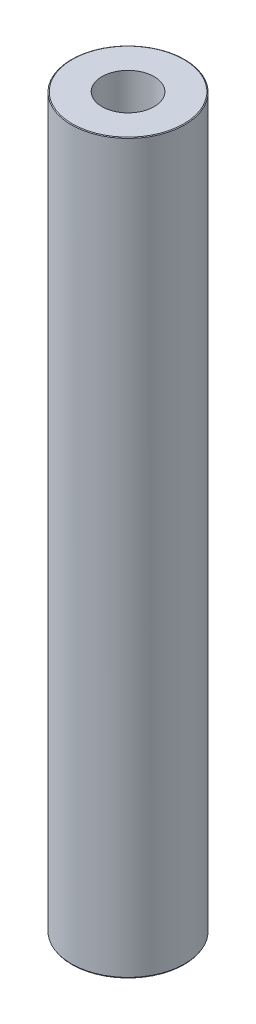
ISO-10303-21;
HEADER;
FILE_DESCRIPTION(('STEP AP214'),'2;1');
FILE_NAME('part.step','',(''),(''),'','','');
FILE_SCHEMA(('AUTOMOTIVE_DESIGN { 1 0 10303 214 1 1 1 1 }'));
ENDSEC;
DATA;
#1=APPLICATION_CONTEXT('core data for automotive mechanical design processes');
#2=APPLICATION_PROTOCOL_DEFINITION('international standard','automotive_design',2000,#1);
#3=PRODUCT_CONTEXT('',#1,'mechanical');
#4=PRODUCT('Part','Part','',(#3));
#5=PRODUCT_RELATED_PRODUCT_CATEGORY('part','',(#4));
#6=PRODUCT_DEFINITION_FORMATION('','',#4);
#7=PRODUCT_DEFINITION_CONTEXT('part definition',#1,'design');
#8=PRODUCT_DEFINITION('design','',#6,#7);
#9=PRODUCT_DEFINITION_SHAPE('','',#8);
#10=(LENGTH_UNIT() NAMED_UNIT(*) SI_UNIT(.MILLI.,.METRE.));
#11=(NAMED_UNIT(*) PLANE_ANGLE_UNIT() SI_UNIT($,.RADIAN.));
#12=(NAMED_UNIT(*) SI_UNIT($,.STERADIAN.) SOLID_ANGLE_UNIT());
#13=UNCERTAINTY_MEASURE_WITH_UNIT(LENGTH_MEASURE(1.E-05),#10,'distance_accuracy_value','');
#14=(GEOMETRIC_REPRESENTATION_CONTEXT(3) GLOBAL_UNCERTAINTY_ASSIGNED_CONTEXT((#13)) GLOBAL_UNIT_ASSIGNED_CONTEXT((#10,
#11,#12)) REPRESENTATION_CONTEXT('',''));
#15=CARTESIAN_POINT('',(0.,0.,0.));
#16=DIRECTION('',(0.,0.,1.));
#17=DIRECTION('',(1.,0.,0.));
#18=AXIS2_PLACEMENT_3D('',#15,#16,#17);
#19=CARTESIAN_POINT('',(0.,353.36021394259,0.));
#20=DIRECTION('',(0.,-1.,0.));
#21=DIRECTION('',(0.,0.,-1.));
#22=AXIS2_PLACEMENT_3D('',#19,#20,#21);
#23=CYLINDRICAL_SURFACE('',#22,27.5);
#24=CARTESIAN_POINT('',(0.,353.113992735957,0.));
#25=DIRECTION('',(0.,1.,0.));
#26=DIRECTION('',(0.,0.,1.));
#27=AXIS2_PLACEMENT_3D('',#24,#25,#26);
#28=CIRCLE('',#27,27.5);
#29=CARTESIAN_POINT('',(0.,353.113992735957,-27.5));
#30=VERTEX_POINT('',#29);
#31=EDGE_CURVE('E50',#30,#30,#28,.F.);
#32=CARTESIAN_POINT('',(0.,0.426467639790484,0.));
#33=DIRECTION('',(0.,1.,0.));
#34=DIRECTION('',(0.,0.,1.));
#35=AXIS2_PLACEMENT_3D('',#32,#33,#34);
#36=CIRCLE('',#35,27.5);
#37=CARTESIAN_POINT('',(0.,0.426467639790429,-27.5));
#38=VERTEX_POINT('',#37);
#39=EDGE_CURVE('E51',#38,#38,#36,.T.);
#40=CARTESIAN_POINT('',(0.,353.113992735957,-27.5));
#41=CARTESIAN_POINT('',(0.,349.440164349538,-27.5));
#42=CARTESIAN_POINT('',(0.,345.76633596312,-27.5));
#43=CARTESIAN_POINT('',(0.,338.418679190283,-27.5));
#44=CARTESIAN_POINT('',(0.,334.744850803865,-27.5));
#45=CARTESIAN_POINT('',(0.,327.397194031028,-27.5));
#46=CARTESIAN_POINT('',(0.,323.723365644609,-27.5));
#47=CARTESIAN_POINT('',(0.,316.375708871773,-27.5));
#48=CARTESIAN_POINT('',(0.,312.701880485354,-27.5));
#49=CARTESIAN_POINT('',(0.,305.354223712517,-27.5));
#50=CARTESIAN_POINT('',(0.,301.680395326099,-27.5));
#51=CARTESIAN_POINT('',(0.,294.332738553262,-27.5));
#52=CARTESIAN_POINT('',(0.,290.658910166844,-27.5));
#53=CARTESIAN_POINT('',(0.,283.311253394007,-27.5));
#54=CARTESIAN_POINT('',(0.,279.637425007589,-27.5));
#55=CARTESIAN_POINT('',(0.,272.289768234752,-27.5));
#56=CARTESIAN_POINT('',(0.,268.615939848333,-27.5));
#57=CARTESIAN_POINT('',(0.,261.268283075497,-27.5));
#58=CARTESIAN_POINT('',(0.,257.594454689078,-27.5));
#59=CARTESIAN_POINT('',(0.,250.246797916241,-27.5));
#60=CARTESIAN_POINT('',(0.,246.572969529823,-27.5));
#61=CARTESIAN_POINT('',(0.,239.225312756986,-27.5));
#62=CARTESIAN_POINT('',(0.,235.551484370568,-27.5));
#63=CARTESIAN_POINT('',(0.,228.203827597731,-27.5));
#64=CARTESIAN_POINT('',(0.,224.529999211313,-27.5));
#65=CARTESIAN_POINT('',(0.,217.182342438476,-27.5));
#66=CARTESIAN_POINT('',(0.,213.508514052058,-27.5));
#67=CARTESIAN_POINT('',(0.,206.160857279221,-27.5));
#68=CARTESIAN_POINT('',(0.,202.487028892802,-27.5));
#69=CARTESIAN_POINT('',(0.,195.139372119966,-27.5));
#70=CARTESIAN_POINT('',(0.,191.465543733547,-27.5));
#71=CARTESIAN_POINT('',(0.,184.11788696071,-27.5));
#72=CARTESIAN_POINT('',(0.,180.444058574292,-27.5));
#73=CARTESIAN_POINT('',(0.,173.096401801455,-27.5));
#74=CARTESIAN_POINT('',(0.,169.422573415037,-27.5));
#75=CARTESIAN_POINT('',(0.,162.0749166422,-27.5));
#76=CARTESIAN_POINT('',(0.,158.401088255782,-27.5));
#77=CARTESIAN_POINT('',(0.,151.053431482945,-27.5));
#78=CARTESIAN_POINT('',(0.,147.379603096526,-27.5));
#79=CARTESIAN_POINT('',(0.,140.03194632369,-27.5));
#80=CARTESIAN_POINT('',(0.,136.358117937271,-27.5));
#81=CARTESIAN_POINT('',(0.,129.010461164434,-27.5));
#82=CARTESIAN_POINT('',(0.,125.336632778016,-27.5));
#83=CARTESIAN_POINT('',(0.,117.988976005179,-27.5));
#84=CARTESIAN_POINT('',(0.,114.315147618761,-27.5));
#85=CARTESIAN_POINT('',(0.,106.967490845924,-27.5));
#86=CARTESIAN_POINT('',(0.,103.293662459506,-27.5));
#87=CARTESIAN_POINT('',(0.,95.9460056866688,-27.5));
#88=CARTESIAN_POINT('',(0.,92.2721773002504,-27.5));
#89=CARTESIAN_POINT('',(0.,84.9245205274136,-27.5));
#90=CARTESIAN_POINT('',(0.,81.2506921409952,-27.5));
#91=CARTESIAN_POINT('',(0.,73.9030353681584,-27.5));
#92=CARTESIAN_POINT('',(0.,70.22920698174,-27.5));
#93=CARTESIAN_POINT('',(0.,62.8815502089032,-27.5));
#94=CARTESIAN_POINT('',(0.,59.2077218224848,-27.5));
#95=CARTESIAN_POINT('',(0.,51.860065049648,-27.5));
#96=CARTESIAN_POINT('',(0.,48.1862366632296,-27.5));
#97=CARTESIAN_POINT('',(0.,40.8385798903928,-27.5));
#98=CARTESIAN_POINT('',(0.,37.1647515039744,-27.5));
#99=CARTESIAN_POINT('',(0.,29.8170947311376,-27.5));
#100=CARTESIAN_POINT('',(0.,26.1432663447192,-27.5));
#101=CARTESIAN_POINT('',(0.,18.7956095718824,-27.5));
#102=CARTESIAN_POINT('',(0.,15.121781185464,-27.5));
#103=CARTESIAN_POINT('',(0.,7.77412441262724,-27.5));
#104=CARTESIAN_POINT('',(0.,4.10029602620884,-27.5));
#105=CARTESIAN_POINT('',(0.,0.426467639790429,-27.5));
#106=B_SPLINE_CURVE_WITH_KNOTS('',3,(#40,#41,#42,#43,#44,#45,#46,#47,#48,#49,#50,#51,#52,#53,
#54,#55,#56,#57,#58,#59,#60,#61,#62,#63,#64,#65,#66,#67,#68,#69,#70,#71,#72,#73,#74,#75,#76,#77,
#78,#79,#80,#81,#82,#83,#84,#85,#86,#87,#88,#89,#90,#91,#92,#93,#94,#95,#96,#97,#98,#99,#100,
#101,#102,#103,#104,#105),.UNSPECIFIED.,.F.,.F.,(4,2,2,2,2,2,2,2,2,2,2,2,2,2,2,2,2,2,2,2,2,2,2,
2,2,2,2,2,2,2,2,2,4),(0.,11.0214851592552,22.0429703185104,33.0644554777655,44.0859406370208,
55.1074257962759,66.1289109555311,77.1503961147863,88.1718812740415,99.1933664332967,
110.214851592552,121.236336751807,132.257821911062,143.279307070317,154.300792229573,
165.322277388828,176.343762548083,187.365247707338,198.386732866593,209.408218025849,
220.429703185104,231.451188344359,242.472673503614,253.494158662869,264.515643822125,
275.53712898138,286.558614140635,297.58009929989,308.601584459145,319.623069618401,
330.644554777656,341.666039936911,352.687525096166),.UNSPECIFIED.);
#107=EDGE_CURVE('BSEAM39',#30,#38,#106,.T.);
#108=ORIENTED_EDGE('',*,*,#31,.T.);
#109=ORIENTED_EDGE('',*,*,#39,.T.);
#110=ORIENTED_EDGE('',*,*,#107,.T.);
#111=ORIENTED_EDGE('',*,*,#107,.F.);
#112=EDGE_LOOP('',(#108,#110,#109,#111));
#113=FACE_BOUND('',#112,.T.);
#114=ADVANCED_FACE('F39',(#113),#23,.T.);
#115=CARTESIAN_POINT('',(0.,353.36021394259,0.));
#116=DIRECTION('',(0.,1.,0.));
#117=DIRECTION('',(0.,0.,1.));
#118=AXIS2_PLACEMENT_3D('',#115,#116,#117);
#119=PLANE('',#118);
#120=CARTESIAN_POINT('',(0.,353.36021394259,0.));
#121=DIRECTION('',(0.,1.,0.));
#122=DIRECTION('',(0.,0.,1.));
#123=AXIS2_PLACEMENT_3D('',#120,#121,#122);
#124=CIRCLE('',#123,27.0735323602105);
#125=CARTESIAN_POINT('',(0.,353.36021394259,27.0735323602105));
#126=VERTEX_POINT('',#125);
#127=EDGE_CURVE('E54',#126,#126,#124,.T.);
#128=ORIENTED_EDGE('',*,*,#127,.T.);
#129=EDGE_LOOP('',(#128));
#130=FACE_BOUND('',#129,.T.);
#131=CARTESIAN_POINT('',(0.,353.36021394259,0.));
#132=DIRECTION('',(0.,1.,0.));
#133=DIRECTION('',(0.,0.,1.));
#134=AXIS2_PLACEMENT_3D('',#131,#132,#133);
#135=CIRCLE('',#134,12.6577041024096);
#136=CARTESIAN_POINT('',(0.,353.36021394259,-12.6577041024096));
#137=VERTEX_POINT('',#136);
#138=EDGE_CURVE('E58',#137,#137,#135,.T.);
#139=ORIENTED_EDGE('',*,*,#138,.F.);
#140=EDGE_LOOP('',(#139));
#141=FACE_BOUND('',#140,.T.);
#142=ADVANCED_FACE('F69',(#130,#141),#119,.T.);
#143=CARTESIAN_POINT('',(0.,0.,0.));
#144=DIRECTION('',(0.,1.,0.));
#145=DIRECTION('',(0.,0.,1.));
#146=AXIS2_PLACEMENT_3D('',#143,#144,#145);
#147=PLANE('',#146);
#148=CARTESIAN_POINT('',(0.,0.,0.));
#149=DIRECTION('',(0.,1.,0.));
#150=DIRECTION('',(0.,0.,1.));
#151=AXIS2_PLACEMENT_3D('',#148,#149,#150);
#152=CIRCLE('',#151,27.2537787933663);
#153=CARTESIAN_POINT('',(0.,0.,27.2537787933663));
#154=VERTEX_POINT('',#153);
#155=EDGE_CURVE('E10',#154,#154,#152,.F.);
#156=ORIENTED_EDGE('',*,*,#155,.T.);
#157=EDGE_LOOP('',(#156));
#158=FACE_BOUND('',#157,.T.);
#159=CARTESIAN_POINT('',(0.,0.,0.));
#160=DIRECTION('',(0.,1.,0.));
#161=DIRECTION('',(0.,0.,1.));
#162=AXIS2_PLACEMENT_3D('',#159,#160,#161);
#163=CIRCLE('',#162,12.6577041024096);
#164=CARTESIAN_POINT('',(0.,0.,-12.6577041024096));
#165=VERTEX_POINT('',#164);
#166=EDGE_CURVE('E63',#165,#165,#163,.T.);
#167=ORIENTED_EDGE('',*,*,#166,.T.);
#168=EDGE_LOOP('',(#167));
#169=FACE_BOUND('',#168,.T.);
#170=ADVANCED_FACE('F75',(#158,#169),#147,.F.);
#171=CARTESIAN_POINT('',(0.,353.36021394259,0.));
#172=DIRECTION('',(0.,-1.,0.));
#173=DIRECTION('',(0.,0.,-1.));
#174=AXIS2_PLACEMENT_3D('',#171,#172,#173);
#175=CYLINDRICAL_SURFACE('',#174,12.6577041024096);
#176=CARTESIAN_POINT('',(0.,353.36021394259,-12.6577041024096));
#177=CARTESIAN_POINT('',(0.,349.679378380688,-12.6577041024096));
#178=CARTESIAN_POINT('',(0.,345.998542818786,-12.6577041024096));
#179=CARTESIAN_POINT('',(0.,338.636871694982,-12.6577041024096));
#180=CARTESIAN_POINT('',(0.,334.95603613308,-12.6577041024096));
#181=CARTESIAN_POINT('',(0.,327.594365009276,-12.6577041024096));
#182=CARTESIAN_POINT('',(0.,323.913529447374,-12.6577041024096));
#183=CARTESIAN_POINT('',(0.,316.55185832357,-12.6577041024096));
#184=CARTESIAN_POINT('',(0.,312.871022761668,-12.6577041024096));
#185=CARTESIAN_POINT('',(0.,305.509351637864,-12.6577041024096));
#186=CARTESIAN_POINT('',(0.,301.828516075962,-12.6577041024096));
#187=CARTESIAN_POINT('',(0.,294.466844952158,-12.6577041024096));
#188=CARTESIAN_POINT('',(0.,290.786009390256,-12.6577041024096));
#189=CARTESIAN_POINT('',(0.,283.424338266452,-12.6577041024096));
#190=CARTESIAN_POINT('',(0.,279.74350270455,-12.6577041024096));
#191=CARTESIAN_POINT('',(0.,272.381831580746,-12.6577041024096));
#192=CARTESIAN_POINT('',(0.,268.700996018844,-12.6577041024096));
#193=CARTESIAN_POINT('',(0.,261.33932489504,-12.6577041024096));
#194=CARTESIAN_POINT('',(0.,257.658489333138,-12.6577041024096));
#195=CARTESIAN_POINT('',(0.,250.296818209334,-12.6577041024096));
#196=CARTESIAN_POINT('',(0.,246.615982647432,-12.6577041024096));
#197=CARTESIAN_POINT('',(0.,239.254311523628,-12.6577041024096));
#198=CARTESIAN_POINT('',(0.,235.573475961726,-12.6577041024096));
#199=CARTESIAN_POINT('',(0.,228.211804837923,-12.6577041024096));
#200=CARTESIAN_POINT('',(0.,224.530969276021,-12.6577041024096));
#201=CARTESIAN_POINT('',(0.,217.169298152217,-12.6577041024096));
#202=CARTESIAN_POINT('',(0.,213.488462590315,-12.6577041024096));
#203=CARTESIAN_POINT('',(0.,206.126791466511,-12.6577041024096));
#204=CARTESIAN_POINT('',(0.,202.445955904609,-12.6577041024096));
#205=CARTESIAN_POINT('',(0.,195.084284780805,-12.6577041024096));
#206=CARTESIAN_POINT('',(0.,191.403449218903,-12.6577041024096));
#207=CARTESIAN_POINT('',(0.,184.041778095099,-12.6577041024096));
#208=CARTESIAN_POINT('',(0.,180.360942533197,-12.6577041024096));
#209=CARTESIAN_POINT('',(0.,172.999271409393,-12.6577041024096));
#210=CARTESIAN_POINT('',(0.,169.318435847491,-12.6577041024096));
#211=CARTESIAN_POINT('',(0.,161.956764723687,-12.6577041024096));
#212=CARTESIAN_POINT('',(0.,158.275929161785,-12.6577041024096));
#213=CARTESIAN_POINT('',(0.,150.914258037981,-12.6577041024096));
#214=CARTESIAN_POINT('',(0.,147.233422476079,-12.6577041024096));
#215=CARTESIAN_POINT('',(0.,139.871751352275,-12.6577041024096));
#216=CARTESIAN_POINT('',(0.,136.190915790373,-12.6577041024096));
#217=CARTESIAN_POINT('',(0.,128.829244666569,-12.6577041024096));
#218=CARTESIAN_POINT('',(0.,125.148409104667,-12.6577041024096));
#219=CARTESIAN_POINT('',(0.,117.786737980863,-12.6577041024096));
#220=CARTESIAN_POINT('',(0.,114.105902418961,-12.6577041024096));
#221=CARTESIAN_POINT('',(0.,106.744231295157,-12.6577041024096));
#222=CARTESIAN_POINT('',(0.,103.063395733255,-12.6577041024096));
#223=CARTESIAN_POINT('',(0.,95.7017246094513,-12.6577041024096));
#224=CARTESIAN_POINT('',(0.,92.0208890475494,-12.6577041024096));
#225=CARTESIAN_POINT('',(0.,84.6592179237454,-12.6577041024096));
#226=CARTESIAN_POINT('',(0.,80.9783823618435,-12.6577041024096));
#227=CARTESIAN_POINT('',(0.,73.6167112380395,-12.6577041024096));
#228=CARTESIAN_POINT('',(0.,69.9358756761375,-12.6577041024096));
#229=CARTESIAN_POINT('',(0.,62.5742045523336,-12.6577041024096));
#230=CARTESIAN_POINT('',(0.,58.8933689904316,-12.6577041024096));
#231=CARTESIAN_POINT('',(0.,51.5316978666276,-12.6577041024096));
#232=CARTESIAN_POINT('',(0.,47.8508623047256,-12.6577041024096));
#233=CARTESIAN_POINT('',(0.,40.4891911809217,-12.6577041024096));
#234=CARTESIAN_POINT('',(0.,36.8083556190197,-12.6577041024096));
#235=CARTESIAN_POINT('',(0.,29.4466844952158,-12.6577041024096));
#236=CARTESIAN_POINT('',(0.,25.7658489333138,-12.6577041024096));
#237=CARTESIAN_POINT('',(0.,18.4041778095099,-12.6577041024096));
#238=CARTESIAN_POINT('',(0.,14.7233422476079,-12.6577041024096));
#239=CARTESIAN_POINT('',(0.,7.36167112380391,-12.6577041024096));
#240=CARTESIAN_POINT('',(0.,3.68083556190192,-12.6577041024096));
#241=CARTESIAN_POINT('',(0.,0.,-12.6577041024096));
#242=B_SPLINE_CURVE_WITH_KNOTS('',3,(#176,#177,#178,#179,#180,#181,#182,#183,#184,#185,#186,
#187,#188,#189,#190,#191,#192,#193,#194,#195,#196,#197,#198,#199,#200,#201,#202,#203,#204,#205,
#206,#207,#208,#209,#210,#211,#212,#213,#214,#215,#216,#217,#218,#219,#220,#221,#222,#223,#224,
#225,#226,#227,#228,#229,#230,#231,#232,#233,#234,#235,#236,#237,#238,#239,#240,#241),
.UNSPECIFIED.,.F.,.F.,(4,2,2,2,2,2,2,2,2,2,2,2,2,2,2,2,2,2,2,2,2,2,2,2,2,2,2,2,2,2,2,2,4),(0.,
11.0425066857059,22.0850133714119,33.1275200571178,44.1700267428238,55.2125334285297,
66.2550401142356,77.2975467999416,88.3400534856475,99.3825601713534,110.425066857059,
121.467573542765,132.510080228471,143.552586914177,154.595093599883,165.637600285589,
176.680106971295,187.722613657001,198.765120342707,209.807627028413,220.850133714119,
231.892640399825,242.935147085531,253.977653771236,265.020160456942,276.062667142648,
287.105173828354,298.14768051406,309.190187199766,320.232693885472,331.275200571178,
342.317707256884,353.36021394259),.UNSPECIFIED.);
#243=EDGE_CURVE('BSEAM70',#137,#165,#242,.T.);
#244=ORIENTED_EDGE('',*,*,#138,.T.);
#245=ORIENTED_EDGE('',*,*,#166,.F.);
#246=ORIENTED_EDGE('',*,*,#243,.T.);
#247=ORIENTED_EDGE('',*,*,#243,.F.);
#248=EDGE_LOOP('',(#244,#246,#245,#247));
#249=FACE_BOUND('',#248,.T.);
#250=ADVANCED_FACE('F70',(#249),#175,.F.);
#251=CARTESIAN_POINT('',(0.,353.36021394259,0.));
#252=DIRECTION('',(0.,-1.,0.));
#253=DIRECTION('',(0.,0.,-1.));
#254=AXIS2_PLACEMENT_3D('',#251,#252,#253);
#255=CONICAL_SURFACE('',#254,27.0735323602105,1.04719755119669);
#256=ORIENTED_EDGE('',*,*,#31,.F.);
#257=EDGE_LOOP('',(#256));
#258=FACE_BOUND('',#257,.T.);
#259=ORIENTED_EDGE('',*,*,#127,.F.);
#260=EDGE_LOOP('',(#259));
#261=FACE_BOUND('',#260,.T.);
#262=ADVANCED_FACE('F81',(#258,#261),#255,.T.);
#263=CARTESIAN_POINT('',(0.,0.426467639790484,0.));
#264=DIRECTION('',(0.,1.,0.));
#265=DIRECTION('',(0.,0.,1.));
#266=AXIS2_PLACEMENT_3D('',#263,#264,#265);
#267=CONICAL_SURFACE('',#266,27.5,0.523598775598269);
#268=ORIENTED_EDGE('',*,*,#155,.F.);
#269=EDGE_LOOP('',(#268));
#270=FACE_BOUND('',#269,.T.);
#271=ORIENTED_EDGE('',*,*,#39,.F.);
#272=EDGE_LOOP('',(#271));
#273=FACE_BOUND('',#272,.T.);
#274=ADVANCED_FACE('F45',(#270,#273),#267,.T.);
#275=CLOSED_SHELL('',(#114,#142,#170,#250,#262,#274));
#276=MANIFOLD_SOLID_BREP('B2',#275);
#277=ADVANCED_BREP_SHAPE_REPRESENTATION('',(#18,#276),#14);
#278=SHAPE_DEFINITION_REPRESENTATION(#9,#277);
ENDSEC;
END-ISO-10303-21;
